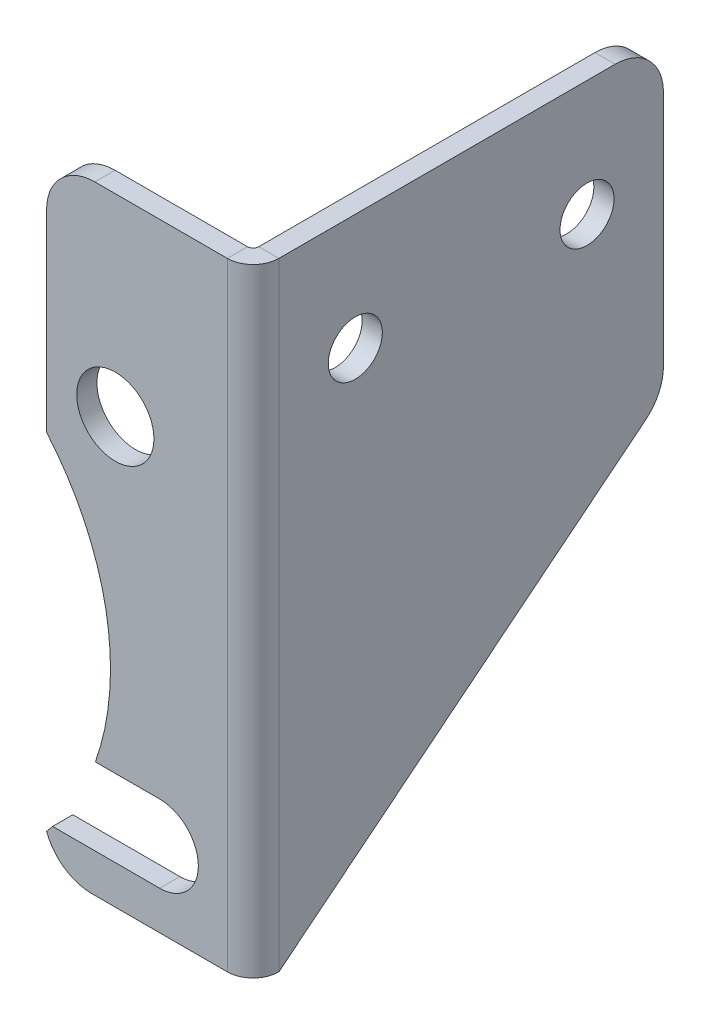
ISO-10303-21;
HEADER;
FILE_DESCRIPTION(('STEP AP214'),'2;1');
FILE_NAME('part.step','',(''),(''),'','','');
FILE_SCHEMA(('AUTOMOTIVE_DESIGN { 1 0 10303 214 1 1 1 1 }'));
ENDSEC;
DATA;
#1=APPLICATION_CONTEXT('core data for automotive mechanical design processes');
#2=APPLICATION_PROTOCOL_DEFINITION('international standard','automotive_design',2000,#1);
#3=PRODUCT_CONTEXT('',#1,'mechanical');
#4=PRODUCT('Part','Part','',(#3));
#5=PRODUCT_RELATED_PRODUCT_CATEGORY('part','',(#4));
#6=PRODUCT_DEFINITION_FORMATION('','',#4);
#7=PRODUCT_DEFINITION_CONTEXT('part definition',#1,'design');
#8=PRODUCT_DEFINITION('design','',#6,#7);
#9=PRODUCT_DEFINITION_SHAPE('','',#8);
#10=(LENGTH_UNIT() NAMED_UNIT(*) SI_UNIT(.MILLI.,.METRE.));
#11=(NAMED_UNIT(*) PLANE_ANGLE_UNIT() SI_UNIT($,.RADIAN.));
#12=(NAMED_UNIT(*) SI_UNIT($,.STERADIAN.) SOLID_ANGLE_UNIT());
#13=UNCERTAINTY_MEASURE_WITH_UNIT(LENGTH_MEASURE(1.E-05),#10,'distance_accuracy_value','');
#14=(GEOMETRIC_REPRESENTATION_CONTEXT(3) GLOBAL_UNCERTAINTY_ASSIGNED_CONTEXT((#13)) GLOBAL_UNIT_ASSIGNED_CONTEXT((#10,
#11,#12)) REPRESENTATION_CONTEXT('',''));
#15=CARTESIAN_POINT('',(0.,0.,0.));
#16=DIRECTION('',(0.,0.,1.));
#17=DIRECTION('',(1.,0.,0.));
#18=AXIS2_PLACEMENT_3D('',#15,#16,#17);
#19=CARTESIAN_POINT('',(15.28064,0.,0.));
#20=DIRECTION('',(-1.,0.,0.));
#21=DIRECTION('',(0.,0.,1.));
#22=AXIS2_PLACEMENT_3D('',#19,#20,#21);
#23=PLANE('',#22);
#24=CARTESIAN_POINT('',(15.28064,25.4,-13.44422));
#25=DIRECTION('',(1.,0.,0.));
#26=DIRECTION('',(0.,0.,-1.));
#27=AXIS2_PLACEMENT_3D('',#24,#25,#26);
#28=CIRCLE('',#27,3.556);
#29=CARTESIAN_POINT('',(15.28064,25.4,-17.00022));
#30=VERTEX_POINT('',#29);
#31=EDGE_CURVE('E638',#30,#30,#28,.T.);
#32=ORIENTED_EDGE('',*,*,#31,.F.);
#33=EDGE_LOOP('',(#32));
#34=FACE_BOUND('',#33,.T.);
#35=DIRECTION('',(0.,1.,0.));
#36=VECTOR('',#35,1.);
#37=CARTESIAN_POINT('',(15.2806400000002,0.,-53.975));
#38=LINE('',#37,#36);
#39=CARTESIAN_POINT('',(15.2806400000002,3.04375222965552,-53.975));
#40=VERTEX_POINT('',#39);
#41=CARTESIAN_POINT('',(15.2806400000002,34.29,-53.975));
#42=VERTEX_POINT('',#41);
#43=EDGE_CURVE('E228',#40,#42,#38,.T.);
#44=ORIENTED_EDGE('',*,*,#43,.T.);
#45=CARTESIAN_POINT('',(15.2806400000002,34.29,-47.625));
#46=DIRECTION('',(-1.,0.,0.));
#47=DIRECTION('',(0.,0.,1.));
#48=AXIS2_PLACEMENT_3D('',#45,#46,#47);
#49=CIRCLE('',#48,6.35);
#50=CARTESIAN_POINT('',(15.2806400000002,40.64,-47.625));
#51=VERTEX_POINT('',#50);
#52=EDGE_CURVE('E328',#42,#51,#49,.F.);
#53=ORIENTED_EDGE('',*,*,#52,.T.);
#54=DIRECTION('',(0.,0.,1.));
#55=VECTOR('',#54,1.);
#56=CARTESIAN_POINT('',(15.28064,40.64,0.));
#57=LINE('',#56,#55);
#58=CARTESIAN_POINT('',(15.28064,40.64,-3.39343999999999));
#59=VERTEX_POINT('',#58);
#60=EDGE_CURVE('E224',#51,#59,#57,.T.);
#61=ORIENTED_EDGE('',*,*,#60,.T.);
#62=DIRECTION('',(0.,-1.,0.));
#63=VECTOR('',#62,1.);
#64=CARTESIAN_POINT('',(15.28064,40.64,-3.39343999999999));
#65=LINE('',#64,#63);
#66=CARTESIAN_POINT('',(15.28064,-40.64,-3.39343999999997));
#67=VERTEX_POINT('',#66);
#68=EDGE_CURVE('E208',#67,#59,#65,.F.);
#69=ORIENTED_EDGE('',*,*,#68,.F.);
#70=DIRECTION('',(0.,-0.626335888215257,0.779553304869914));
#71=VECTOR('',#70,1.);
#72=CARTESIAN_POINT('',(15.28064,-40.64,-3.39343999999997));
#73=LINE('',#72,#71);
#74=CARTESIAN_POINT('',(15.2806400000002,-1.90641125626843,-51.6022328901669));
#75=VERTEX_POINT('',#74);
#76=EDGE_CURVE('E198',#75,#67,#73,.T.);
#77=ORIENTED_EDGE('',*,*,#76,.F.);
#78=CARTESIAN_POINT('',(15.2806400000002,3.04375222965552,-47.625));
#79=DIRECTION('',(-1.,0.,0.));
#80=DIRECTION('',(0.,0.,1.));
#81=AXIS2_PLACEMENT_3D('',#78,#79,#80);
#82=CIRCLE('',#81,6.35);
#83=EDGE_CURVE('E326',#75,#40,#82,.F.);
#84=ORIENTED_EDGE('',*,*,#83,.T.);
#85=EDGE_LOOP('',(#44,#53,#61,#69,#77,#84));
#86=FACE_BOUND('',#85,.T.);
#87=CARTESIAN_POINT('',(15.2806400000001,25.4,-43.92422));
#88=DIRECTION('',(1.,0.,0.));
#89=DIRECTION('',(0.,0.,-1.));
#90=AXIS2_PLACEMENT_3D('',#87,#88,#89);
#91=CIRCLE('',#90,3.55600000000001);
#92=CARTESIAN_POINT('',(15.2806400000002,25.4,-47.48022));
#93=VERTEX_POINT('',#92);
#94=EDGE_CURVE('E646',#93,#93,#91,.T.);
#95=ORIENTED_EDGE('',*,*,#94,.F.);
#96=EDGE_LOOP('',(#95));
#97=FACE_BOUND('',#96,.T.);
#98=ADVANCED_FACE('F69',(#34,#86,#97),#23,.F.);
#99=CARTESIAN_POINT('',(12.6238,0.,0.));
#100=DIRECTION('',(-1.,0.,0.));
#101=DIRECTION('',(0.,0.,1.));
#102=AXIS2_PLACEMENT_3D('',#99,#100,#101);
#103=PLANE('',#102);
#104=DIRECTION('',(0.,0.,-1.));
#105=VECTOR('',#104,1.);
#106=CARTESIAN_POINT('',(12.6238,40.64,-2.65684));
#107=LINE('',#106,#105);
#108=CARTESIAN_POINT('',(12.6238000000002,40.64,-47.625));
#109=VERTEX_POINT('',#108);
#110=CARTESIAN_POINT('',(12.6238,40.64,-3.39344));
#111=VERTEX_POINT('',#110);
#112=EDGE_CURVE('E628',#109,#111,#107,.F.);
#113=ORIENTED_EDGE('',*,*,#112,.F.);
#114=CARTESIAN_POINT('',(12.6238000000002,34.29,-47.625));
#115=DIRECTION('',(-1.,0.,0.));
#116=DIRECTION('',(0.,0.,1.));
#117=AXIS2_PLACEMENT_3D('',#114,#115,#116);
#118=CIRCLE('',#117,6.35);
#119=CARTESIAN_POINT('',(12.6238000000002,34.29,-53.975));
#120=VERTEX_POINT('',#119);
#121=EDGE_CURVE('E320',#109,#120,#118,.T.);
#122=ORIENTED_EDGE('',*,*,#121,.T.);
#123=DIRECTION('',(0.,-1.,0.));
#124=VECTOR('',#123,1.);
#125=CARTESIAN_POINT('',(12.6238000000002,40.64,-53.975));
#126=LINE('',#125,#124);
#127=CARTESIAN_POINT('',(12.6238000000002,3.04375222965552,-53.975));
#128=VERTEX_POINT('',#127);
#129=EDGE_CURVE('E630',#128,#120,#126,.F.);
#130=ORIENTED_EDGE('',*,*,#129,.F.);
#131=CARTESIAN_POINT('',(12.6238000000002,3.04375222965552,-47.625));
#132=DIRECTION('',(-1.,0.,0.));
#133=DIRECTION('',(0.,0.,1.));
#134=AXIS2_PLACEMENT_3D('',#131,#132,#133);
#135=CIRCLE('',#134,6.35);
#136=CARTESIAN_POINT('',(12.6238000000002,-1.90641125626843,-51.6022328901669));
#137=VERTEX_POINT('',#136);
#138=EDGE_CURVE('E196',#128,#137,#135,.T.);
#139=ORIENTED_EDGE('',*,*,#138,.T.);
#140=DIRECTION('',(0.,-0.626335888215257,0.779553304869914));
#141=VECTOR('',#140,1.);
#142=CARTESIAN_POINT('',(12.6238,-40.64,-3.39343999999998));
#143=LINE('',#142,#141);
#144=CARTESIAN_POINT('',(12.6238,-40.64,-3.39343999999998));
#145=VERTEX_POINT('',#144);
#146=EDGE_CURVE('E188',#137,#145,#143,.T.);
#147=ORIENTED_EDGE('',*,*,#146,.T.);
#148=DIRECTION('',(0.,-1.,0.));
#149=VECTOR('',#148,1.);
#150=CARTESIAN_POINT('',(12.6238,40.64,-3.39344));
#151=LINE('',#150,#149);
#152=EDGE_CURVE('E194',#111,#145,#151,.T.);
#153=ORIENTED_EDGE('',*,*,#152,.F.);
#154=EDGE_LOOP('',(#113,#122,#130,#139,#147,#153));
#155=FACE_BOUND('',#154,.T.);
#156=CARTESIAN_POINT('',(12.6238,25.4,-13.44422));
#157=DIRECTION('',(1.,0.,0.));
#158=DIRECTION('',(0.,0.,-1.));
#159=AXIS2_PLACEMENT_3D('',#156,#157,#158);
#160=CIRCLE('',#159,3.556);
#161=CARTESIAN_POINT('',(12.6238,25.4,-17.00022));
#162=VERTEX_POINT('',#161);
#163=EDGE_CURVE('E643',#162,#162,#160,.T.);
#164=ORIENTED_EDGE('',*,*,#163,.T.);
#165=EDGE_LOOP('',(#164));
#166=FACE_BOUND('',#165,.T.);
#167=CARTESIAN_POINT('',(12.6238000000001,25.4,-43.92422));
#168=DIRECTION('',(1.,0.,0.));
#169=DIRECTION('',(0.,0.,-1.));
#170=AXIS2_PLACEMENT_3D('',#167,#168,#169);
#171=CIRCLE('',#170,3.55600000000001);
#172=CARTESIAN_POINT('',(12.6238000000002,25.4,-47.48022));
#173=VERTEX_POINT('',#172);
#174=EDGE_CURVE('E197',#173,#173,#171,.T.);
#175=ORIENTED_EDGE('',*,*,#174,.T.);
#176=EDGE_LOOP('',(#175));
#177=FACE_BOUND('',#176,.T.);
#178=ADVANCED_FACE('F191',(#155,#166,#177),#103,.T.);
#179=CARTESIAN_POINT('',(15.2806400000002,40.64,-53.975));
#180=DIRECTION('',(0.,0.,1.));
#181=DIRECTION('',(1.,0.,0.));
#182=AXIS2_PLACEMENT_3D('',#179,#180,#181);
#183=PLANE('',#182);
#184=ORIENTED_EDGE('',*,*,#129,.T.);
#185=DIRECTION('',(-1.,0.,0.));
#186=VECTOR('',#185,1.);
#187=CARTESIAN_POINT('',(15.2806400000002,34.29,-53.975));
#188=LINE('',#187,#186);
#189=EDGE_CURVE('E90',#120,#42,#188,.F.);
#190=ORIENTED_EDGE('',*,*,#189,.T.);
#191=ORIENTED_EDGE('',*,*,#43,.F.);
#192=DIRECTION('',(-1.,0.,0.));
#193=VECTOR('',#192,1.);
#194=CARTESIAN_POINT('',(12.6238000000002,3.04375222965552,-53.975));
#195=LINE('',#194,#193);
#196=EDGE_CURVE('E322',#40,#128,#195,.T.);
#197=ORIENTED_EDGE('',*,*,#196,.T.);
#198=EDGE_LOOP('',(#184,#190,#191,#197));
#199=FACE_BOUND('',#198,.T.);
#200=ADVANCED_FACE('F401',(#199),#183,.F.);
#201=CARTESIAN_POINT('',(-11.8872,40.64,-2.65684));
#202=DIRECTION('',(-1.,0.,0.));
#203=DIRECTION('',(0.,0.,1.));
#204=AXIS2_PLACEMENT_3D('',#201,#202,#203);
#205=PLANE('',#204);
#206=DIRECTION('',(0.,-1.,0.));
#207=VECTOR('',#206,1.);
#208=CARTESIAN_POINT('',(-11.8872,40.64,0.));
#209=LINE('',#208,#207);
#210=CARTESIAN_POINT('',(-11.8872,34.29,0.));
#211=VERTEX_POINT('',#210);
#212=CARTESIAN_POINT('',(-11.8872,8.93603167868545,0.));
#213=VERTEX_POINT('',#212);
#214=EDGE_CURVE('E235',#211,#213,#209,.T.);
#215=ORIENTED_EDGE('',*,*,#214,.F.);
#216=DIRECTION('',(0.,0.,1.));
#217=VECTOR('',#216,1.);
#218=CARTESIAN_POINT('',(-11.8872,34.29,-2.65684));
#219=LINE('',#218,#217);
#220=CARTESIAN_POINT('',(-11.8872,34.29,-2.65684));
#221=VERTEX_POINT('',#220);
#222=EDGE_CURVE('E77',#211,#221,#219,.F.);
#223=ORIENTED_EDGE('',*,*,#222,.T.);
#224=DIRECTION('',(0.,-1.,0.));
#225=VECTOR('',#224,1.);
#226=CARTESIAN_POINT('',(-11.8872,40.64,-2.65684));
#227=LINE('',#226,#225);
#228=CARTESIAN_POINT('',(-11.8872,8.93603167868545,-2.65684));
#229=VERTEX_POINT('',#228);
#230=EDGE_CURVE('E240',#221,#229,#227,.T.);
#231=ORIENTED_EDGE('',*,*,#230,.T.);
#232=DIRECTION('',(0.,0.,1.));
#233=VECTOR('',#232,1.);
#234=CARTESIAN_POINT('',(-11.8872,8.93603167868545,-2.65684));
#235=LINE('',#234,#233);
#236=EDGE_CURVE('E265',#229,#213,#235,.T.);
#237=ORIENTED_EDGE('',*,*,#236,.T.);
#238=EDGE_LOOP('',(#215,#223,#231,#237));
#239=FACE_BOUND('',#238,.T.);
#240=ADVANCED_FACE('F336',(#239),#205,.T.);
#241=CARTESIAN_POINT('',(-11.8872,40.64,-2.65684));
#242=DIRECTION('',(0.,1.,0.));
#243=DIRECTION('',(0.,0.,1.));
#244=AXIS2_PLACEMENT_3D('',#241,#242,#243);
#245=PLANE('',#244);
#246=DIRECTION('',(-1.,0.,0.));
#247=VECTOR('',#246,1.);
#248=CARTESIAN_POINT('',(-11.8872,40.64,-2.65684));
#249=LINE('',#248,#247);
#250=CARTESIAN_POINT('',(11.8872,40.64,-2.65684));
#251=VERTEX_POINT('',#250);
#252=CARTESIAN_POINT('',(-5.5372,40.64,-2.65684));
#253=VERTEX_POINT('',#252);
#254=EDGE_CURVE('E262',#251,#253,#249,.T.);
#255=ORIENTED_EDGE('',*,*,#254,.T.);
#256=DIRECTION('',(0.,0.,1.));
#257=VECTOR('',#256,1.);
#258=CARTESIAN_POINT('',(-5.5372,40.64,-2.65684));
#259=LINE('',#258,#257);
#260=CARTESIAN_POINT('',(-5.5372,40.64,0.));
#261=VERTEX_POINT('',#260);
#262=EDGE_CURVE('E330',#253,#261,#259,.T.);
#263=ORIENTED_EDGE('',*,*,#262,.T.);
#264=DIRECTION('',(-1.,0.,0.));
#265=VECTOR('',#264,1.);
#266=CARTESIAN_POINT('',(-11.8872,40.64,0.));
#267=LINE('',#266,#265);
#268=CARTESIAN_POINT('',(11.8872,40.64,0.));
#269=VERTEX_POINT('',#268);
#270=EDGE_CURVE('E243',#269,#261,#267,.T.);
#271=ORIENTED_EDGE('',*,*,#270,.F.);
#272=DIRECTION('',(0.,0.,1.));
#273=VECTOR('',#272,1.);
#274=CARTESIAN_POINT('',(11.8872,40.64,-2.65684));
#275=LINE('',#274,#273);
#276=EDGE_CURVE('E289',#251,#269,#275,.T.);
#277=ORIENTED_EDGE('',*,*,#276,.F.);
#278=EDGE_LOOP('',(#255,#263,#271,#277));
#279=FACE_BOUND('',#278,.T.);
#280=ADVANCED_FACE('F350',(#279),#245,.T.);
#281=CARTESIAN_POINT('',(-11.8872,-40.64,-2.65684));
#282=DIRECTION('',(0.,-1.,0.));
#283=DIRECTION('',(0.,0.,-1.));
#284=AXIS2_PLACEMENT_3D('',#281,#282,#283);
#285=PLANE('',#284);
#286=DIRECTION('',(1.,0.,0.));
#287=VECTOR('',#286,1.);
#288=CARTESIAN_POINT('',(-11.8872,-40.64,0.));
#289=LINE('',#288,#287);
#290=CARTESIAN_POINT('',(-5.94180896771993,-40.64,0.));
#291=VERTEX_POINT('',#290);
#292=CARTESIAN_POINT('',(11.8872,-40.64,0.));
#293=VERTEX_POINT('',#292);
#294=EDGE_CURVE('E282',#291,#293,#289,.T.);
#295=ORIENTED_EDGE('',*,*,#294,.F.);
#296=DIRECTION('',(0.,0.,-1.));
#297=VECTOR('',#296,1.);
#298=CARTESIAN_POINT('',(-5.94180896771993,-40.64,-2.65684));
#299=LINE('',#298,#297);
#300=CARTESIAN_POINT('',(-5.94180896771993,-40.64,-2.65684));
#301=VERTEX_POINT('',#300);
#302=EDGE_CURVE('E310',#291,#301,#299,.T.);
#303=ORIENTED_EDGE('',*,*,#302,.T.);
#304=DIRECTION('',(1.,0.,0.));
#305=VECTOR('',#304,1.);
#306=CARTESIAN_POINT('',(-11.8872,-40.64,-2.65684));
#307=LINE('',#306,#305);
#308=CARTESIAN_POINT('',(11.8872,-40.64,-2.65684));
#309=VERTEX_POINT('',#308);
#310=EDGE_CURVE('E258',#301,#309,#307,.T.);
#311=ORIENTED_EDGE('',*,*,#310,.T.);
#312=DIRECTION('',(0.,0.,1.));
#313=VECTOR('',#312,1.);
#314=CARTESIAN_POINT('',(11.8872,-40.64,-2.65684));
#315=LINE('',#314,#313);
#316=EDGE_CURVE('E223',#309,#293,#315,.T.);
#317=ORIENTED_EDGE('',*,*,#316,.T.);
#318=EDGE_LOOP('',(#295,#303,#311,#317));
#319=FACE_BOUND('',#318,.T.);
#320=ADVANCED_FACE('F361',(#319),#285,.T.);
#321=CARTESIAN_POINT('',(-38.4048,-13.7922,-2.65684));
#322=DIRECTION('',(0.,0.,1.));
#323=DIRECTION('',(1.,0.,0.));
#324=AXIS2_PLACEMENT_3D('',#321,#322,#323);
#325=CYLINDRICAL_SURFACE('',#324,34.925);
#326=CARTESIAN_POINT('',(-38.4048,-13.7922,0.));
#327=DIRECTION('',(0.,0.,-1.));
#328=DIRECTION('',(1.,0.,0.));
#329=AXIS2_PLACEMENT_3D('',#326,#327,#328);
#330=CIRCLE('',#329,34.925);
#331=CARTESIAN_POINT('',(-11.0932912873712,-35.56,0.));
#332=VERTEX_POINT('',#331);
#333=CARTESIAN_POINT('',(-11.8872,-36.5204316786854,0.));
#334=VERTEX_POINT('',#333);
#335=EDGE_CURVE('E279',#332,#334,#330,.T.);
#336=ORIENTED_EDGE('',*,*,#335,.F.);
#337=DIRECTION('',(0.,0.,1.));
#338=VECTOR('',#337,1.);
#339=CARTESIAN_POINT('',(-11.0932912873712,-35.56,-2.65684));
#340=LINE('',#339,#338);
#341=CARTESIAN_POINT('',(-11.0932912873712,-35.56,-2.65684));
#342=VERTEX_POINT('',#341);
#343=EDGE_CURVE('E297',#342,#332,#340,.T.);
#344=ORIENTED_EDGE('',*,*,#343,.F.);
#345=CARTESIAN_POINT('',(-38.4048,-13.7922,-2.65684));
#346=DIRECTION('',(0.,0.,-1.));
#347=DIRECTION('',(1.,0.,0.));
#348=AXIS2_PLACEMENT_3D('',#345,#346,#347);
#349=CIRCLE('',#348,34.925);
#350=CARTESIAN_POINT('',(-11.8872,-36.5204316786854,-2.65684));
#351=VERTEX_POINT('',#350);
#352=EDGE_CURVE('E255',#342,#351,#349,.T.);
#353=ORIENTED_EDGE('',*,*,#352,.T.);
#354=DIRECTION('',(0.,0.,1.));
#355=VECTOR('',#354,1.);
#356=CARTESIAN_POINT('',(-11.8872,-36.5204316786854,-2.65684));
#357=LINE('',#356,#355);
#358=EDGE_CURVE('E294',#351,#334,#357,.T.);
#359=ORIENTED_EDGE('',*,*,#358,.T.);
#360=EDGE_LOOP('',(#336,#344,#353,#359));
#361=FACE_BOUND('',#360,.T.);
#362=ADVANCED_FACE('F370',(#361),#325,.F.);
#363=CARTESIAN_POINT('',(2.99720000000001,-35.56,-2.65684));
#364=DIRECTION('',(0.,1.,0.));
#365=DIRECTION('',(0.,0.,1.));
#366=AXIS2_PLACEMENT_3D('',#363,#364,#365);
#367=PLANE('',#366);
#368=DIRECTION('',(-1.,0.,0.));
#369=VECTOR('',#368,1.);
#370=CARTESIAN_POINT('',(2.99720000000001,-35.56,0.));
#371=LINE('',#370,#369);
#372=CARTESIAN_POINT('',(2.99720000000001,-35.56,0.));
#373=VERTEX_POINT('',#372);
#374=EDGE_CURVE('E276',#373,#332,#371,.T.);
#375=ORIENTED_EDGE('',*,*,#374,.F.);
#376=DIRECTION('',(0.,0.,1.));
#377=VECTOR('',#376,1.);
#378=CARTESIAN_POINT('',(2.99720000000001,-35.56,-2.65684));
#379=LINE('',#378,#377);
#380=CARTESIAN_POINT('',(2.99720000000001,-35.56,-2.65684));
#381=VERTEX_POINT('',#380);
#382=EDGE_CURVE('E299',#381,#373,#379,.T.);
#383=ORIENTED_EDGE('',*,*,#382,.F.);
#384=DIRECTION('',(-1.,0.,0.));
#385=VECTOR('',#384,1.);
#386=CARTESIAN_POINT('',(2.99720000000001,-35.56,-2.65684));
#387=LINE('',#386,#385);
#388=EDGE_CURVE('E252',#381,#342,#387,.T.);
#389=ORIENTED_EDGE('',*,*,#388,.T.);
#390=ORIENTED_EDGE('',*,*,#343,.T.);
#391=EDGE_LOOP('',(#375,#383,#389,#390));
#392=FACE_BOUND('',#391,.T.);
#393=ADVANCED_FACE('F374',(#392),#367,.T.);
#394=CARTESIAN_POINT('',(2.99720000000001,-30.48,-2.65684));
#395=DIRECTION('',(0.,0.,1.));
#396=DIRECTION('',(1.,0.,0.));
#397=AXIS2_PLACEMENT_3D('',#394,#395,#396);
#398=CYLINDRICAL_SURFACE('',#397,5.08);
#399=CARTESIAN_POINT('',(2.99720000000001,-30.48,0.));
#400=DIRECTION('',(0.,0.,-1.));
#401=DIRECTION('',(1.,0.,0.));
#402=AXIS2_PLACEMENT_3D('',#399,#400,#401);
#403=CIRCLE('',#402,5.08);
#404=CARTESIAN_POINT('',(2.99720000000001,-25.4,0.));
#405=VERTEX_POINT('',#404);
#406=EDGE_CURVE('E273',#405,#373,#403,.T.);
#407=ORIENTED_EDGE('',*,*,#406,.F.);
#408=DIRECTION('',(0.,0.,1.));
#409=VECTOR('',#408,1.);
#410=CARTESIAN_POINT('',(2.99720000000001,-25.4,-2.65684));
#411=LINE('',#410,#409);
#412=CARTESIAN_POINT('',(2.99720000000001,-25.4,-2.65684));
#413=VERTEX_POINT('',#412);
#414=EDGE_CURVE('E301',#413,#405,#411,.T.);
#415=ORIENTED_EDGE('',*,*,#414,.F.);
#416=CARTESIAN_POINT('',(2.99720000000001,-30.48,-2.65684));
#417=DIRECTION('',(0.,0.,-1.));
#418=DIRECTION('',(1.,0.,0.));
#419=AXIS2_PLACEMENT_3D('',#416,#417,#418);
#420=CIRCLE('',#419,5.08);
#421=EDGE_CURVE('E249',#413,#381,#420,.T.);
#422=ORIENTED_EDGE('',*,*,#421,.T.);
#423=ORIENTED_EDGE('',*,*,#382,.T.);
#424=EDGE_LOOP('',(#407,#415,#422,#423));
#425=FACE_BOUND('',#424,.T.);
#426=ADVANCED_FACE('F378',(#425),#398,.F.);
#427=CARTESIAN_POINT('',(2.99720000000001,-25.4,-2.65684));
#428=DIRECTION('',(0.,-1.,0.));
#429=DIRECTION('',(0.,0.,-1.));
#430=AXIS2_PLACEMENT_3D('',#427,#428,#429);
#431=PLANE('',#430);
#432=DIRECTION('',(1.,0.,0.));
#433=VECTOR('',#432,1.);
#434=CARTESIAN_POINT('',(2.99720000000001,-25.4,0.));
#435=LINE('',#434,#433);
#436=CARTESIAN_POINT('',(-5.46524013408798,-25.4,0.));
#437=VERTEX_POINT('',#436);
#438=EDGE_CURVE('E270',#437,#405,#435,.T.);
#439=ORIENTED_EDGE('',*,*,#438,.F.);
#440=DIRECTION('',(0.,0.,1.));
#441=VECTOR('',#440,1.);
#442=CARTESIAN_POINT('',(-5.46524013408798,-25.4,-2.65684));
#443=LINE('',#442,#441);
#444=CARTESIAN_POINT('',(-5.46524013408798,-25.4,-2.65684));
#445=VERTEX_POINT('',#444);
#446=EDGE_CURVE('E303',#445,#437,#443,.T.);
#447=ORIENTED_EDGE('',*,*,#446,.F.);
#448=DIRECTION('',(1.,0.,0.));
#449=VECTOR('',#448,1.);
#450=CARTESIAN_POINT('',(2.99720000000001,-25.4,-2.65684));
#451=LINE('',#450,#449);
#452=EDGE_CURVE('E246',#445,#413,#451,.T.);
#453=ORIENTED_EDGE('',*,*,#452,.T.);
#454=ORIENTED_EDGE('',*,*,#414,.T.);
#455=EDGE_LOOP('',(#439,#447,#453,#454));
#456=FACE_BOUND('',#455,.T.);
#457=ADVANCED_FACE('F381',(#456),#431,.T.);
#458=CARTESIAN_POINT('',(-38.4048,-13.7922,-2.65684));
#459=DIRECTION('',(0.,0.,1.));
#460=DIRECTION('',(1.,0.,0.));
#461=AXIS2_PLACEMENT_3D('',#458,#459,#460);
#462=CYLINDRICAL_SURFACE('',#461,34.925);
#463=CARTESIAN_POINT('',(-38.4048,-13.7922,0.));
#464=DIRECTION('',(0.,0.,-1.));
#465=DIRECTION('',(1.,0.,0.));
#466=AXIS2_PLACEMENT_3D('',#463,#464,#465);
#467=CIRCLE('',#466,34.925);
#468=EDGE_CURVE('E267',#213,#437,#467,.T.);
#469=ORIENTED_EDGE('',*,*,#468,.F.);
#470=ORIENTED_EDGE('',*,*,#236,.F.);
#471=CARTESIAN_POINT('',(-38.4048,-13.7922,-2.65684));
#472=DIRECTION('',(0.,0.,-1.));
#473=DIRECTION('',(1.,0.,0.));
#474=AXIS2_PLACEMENT_3D('',#471,#472,#473);
#475=CIRCLE('',#474,34.925);
#476=EDGE_CURVE('E242',#229,#445,#475,.T.);
#477=ORIENTED_EDGE('',*,*,#476,.T.);
#478=ORIENTED_EDGE('',*,*,#446,.T.);
#479=EDGE_LOOP('',(#469,#470,#477,#478));
#480=FACE_BOUND('',#479,.T.);
#481=ADVANCED_FACE('F384',(#480),#462,.F.);
#482=CARTESIAN_POINT('',(-38.4048,-13.7922,-2.65684));
#483=DIRECTION('',(0.,0.,1.));
#484=DIRECTION('',(1.,0.,0.));
#485=AXIS2_PLACEMENT_3D('',#482,#483,#484);
#486=PLANE('',#485);
#487=CARTESIAN_POINT('',(-2.84479999999999,15.24,-2.65684));
#488=DIRECTION('',(0.,0.,1.));
#489=DIRECTION('',(1.,0.,0.));
#490=AXIS2_PLACEMENT_3D('',#487,#488,#489);
#491=CIRCLE('',#490,5.08);
#492=CARTESIAN_POINT('',(2.23520000000001,15.24,-2.65684));
#493=VERTEX_POINT('',#492);
#494=EDGE_CURVE('E232',#493,#493,#491,.T.);
#495=ORIENTED_EDGE('',*,*,#494,.T.);
#496=EDGE_LOOP('',(#495));
#497=FACE_BOUND('',#496,.T.);
#498=ORIENTED_EDGE('',*,*,#310,.F.);
#499=CARTESIAN_POINT('',(-5.94180896771993,-34.29,-2.65684));
#500=DIRECTION('',(0.,0.,1.));
#501=DIRECTION('',(1.,0.,0.));
#502=AXIS2_PLACEMENT_3D('',#499,#500,#501);
#503=CIRCLE('',#502,6.35);
#504=EDGE_CURVE('E314',#301,#351,#503,.F.);
#505=ORIENTED_EDGE('',*,*,#504,.T.);
#506=ORIENTED_EDGE('',*,*,#352,.F.);
#507=ORIENTED_EDGE('',*,*,#388,.F.);
#508=ORIENTED_EDGE('',*,*,#421,.F.);
#509=ORIENTED_EDGE('',*,*,#452,.F.);
#510=ORIENTED_EDGE('',*,*,#476,.F.);
#511=ORIENTED_EDGE('',*,*,#230,.F.);
#512=CARTESIAN_POINT('',(-5.5372,34.29,-2.65684));
#513=DIRECTION('',(0.,0.,1.));
#514=DIRECTION('',(1.,0.,0.));
#515=AXIS2_PLACEMENT_3D('',#512,#513,#514);
#516=CIRCLE('',#515,6.35);
#517=EDGE_CURVE('E312',#221,#253,#516,.F.);
#518=ORIENTED_EDGE('',*,*,#517,.T.);
#519=ORIENTED_EDGE('',*,*,#254,.F.);
#520=DIRECTION('',(0.,1.,0.));
#521=VECTOR('',#520,1.);
#522=CARTESIAN_POINT('',(11.8872,40.64,-2.65684));
#523=LINE('',#522,#521);
#524=EDGE_CURVE('E260',#309,#251,#523,.T.);
#525=ORIENTED_EDGE('',*,*,#524,.F.);
#526=EDGE_LOOP('',(#498,#505,#506,#507,#508,#509,#510,#511,#518,#519,#525));
#527=FACE_BOUND('',#526,.T.);
#528=ADVANCED_FACE('F343',(#497,#527),#486,.F.);
#529=CARTESIAN_POINT('',(-38.4048,-13.7922,0.));
#530=DIRECTION('',(0.,0.,1.));
#531=DIRECTION('',(1.,0.,0.));
#532=AXIS2_PLACEMENT_3D('',#529,#530,#531);
#533=PLANE('',#532);
#534=CARTESIAN_POINT('',(-2.84479999999999,15.24,0.));
#535=DIRECTION('',(0.,0.,1.));
#536=DIRECTION('',(1.,0.,0.));
#537=AXIS2_PLACEMENT_3D('',#534,#535,#536);
#538=CIRCLE('',#537,5.08);
#539=CARTESIAN_POINT('',(2.23520000000001,15.24,0.));
#540=VERTEX_POINT('',#539);
#541=EDGE_CURVE('E236',#540,#540,#538,.T.);
#542=ORIENTED_EDGE('',*,*,#541,.F.);
#543=EDGE_LOOP('',(#542));
#544=FACE_BOUND('',#543,.T.);
#545=ORIENTED_EDGE('',*,*,#335,.T.);
#546=CARTESIAN_POINT('',(-5.94180896771993,-34.29,0.));
#547=DIRECTION('',(0.,0.,1.));
#548=DIRECTION('',(1.,0.,0.));
#549=AXIS2_PLACEMENT_3D('',#546,#547,#548);
#550=CIRCLE('',#549,6.35);
#551=EDGE_CURVE('E308',#334,#291,#550,.T.);
#552=ORIENTED_EDGE('',*,*,#551,.T.);
#553=ORIENTED_EDGE('',*,*,#294,.T.);
#554=DIRECTION('',(0.,1.,0.));
#555=VECTOR('',#554,1.);
#556=CARTESIAN_POINT('',(11.8872,40.64,0.));
#557=LINE('',#556,#555);
#558=EDGE_CURVE('E284',#293,#269,#557,.T.);
#559=ORIENTED_EDGE('',*,*,#558,.T.);
#560=ORIENTED_EDGE('',*,*,#270,.T.);
#561=CARTESIAN_POINT('',(-5.5372,34.29,0.));
#562=DIRECTION('',(0.,0.,1.));
#563=DIRECTION('',(1.,0.,0.));
#564=AXIS2_PLACEMENT_3D('',#561,#562,#563);
#565=CIRCLE('',#564,6.35);
#566=EDGE_CURVE('E292',#261,#211,#565,.T.);
#567=ORIENTED_EDGE('',*,*,#566,.T.);
#568=ORIENTED_EDGE('',*,*,#214,.T.);
#569=ORIENTED_EDGE('',*,*,#468,.T.);
#570=ORIENTED_EDGE('',*,*,#438,.T.);
#571=ORIENTED_EDGE('',*,*,#406,.T.);
#572=ORIENTED_EDGE('',*,*,#374,.T.);
#573=EDGE_LOOP('',(#545,#552,#553,#559,#560,#567,#568,#569,#570,#571,#572));
#574=FACE_BOUND('',#573,.T.);
#575=ADVANCED_FACE('F353',(#544,#574),#533,.T.);
#576=CARTESIAN_POINT('',(-2.84479999999999,15.24,-2.65684));
#577=DIRECTION('',(0.,0.,1.));
#578=DIRECTION('',(1.,0.,0.));
#579=AXIS2_PLACEMENT_3D('',#576,#577,#578);
#580=CYLINDRICAL_SURFACE('',#579,5.08);
#581=ORIENTED_EDGE('',*,*,#494,.F.);
#582=EDGE_LOOP('',(#581));
#583=FACE_BOUND('',#582,.T.);
#584=ORIENTED_EDGE('',*,*,#541,.T.);
#585=EDGE_LOOP('',(#584));
#586=FACE_BOUND('',#585,.T.);
#587=ADVANCED_FACE('F422',(#583,#586),#580,.F.);
#588=CARTESIAN_POINT('',(11.8872,40.64,-3.39344));
#589=DIRECTION('',(0.,1.,0.));
#590=DIRECTION('',(0.,0.,1.));
#591=AXIS2_PLACEMENT_3D('',#588,#589,#590);
#592=PLANE('',#591);
#593=DIRECTION('',(-1.,0.,0.));
#594=VECTOR('',#593,1.);
#595=CARTESIAN_POINT('',(15.28064,40.64,-3.39343999999999));
#596=LINE('',#595,#594);
#597=EDGE_CURVE('E218',#111,#59,#596,.F.);
#598=ORIENTED_EDGE('',*,*,#597,.F.);
#599=CARTESIAN_POINT('',(11.8872,40.64,-3.39344));
#600=DIRECTION('',(0.,-1.,0.));
#601=DIRECTION('',(0.,0.,-1.));
#602=AXIS2_PLACEMENT_3D('',#599,#600,#601);
#603=CIRCLE('',#602,0.7366);
#604=EDGE_CURVE('E217',#251,#111,#603,.F.);
#605=ORIENTED_EDGE('',*,*,#604,.F.);
#606=ORIENTED_EDGE('',*,*,#276,.T.);
#607=CARTESIAN_POINT('',(11.8872,40.64,-3.39344));
#608=DIRECTION('',(0.,-1.,0.));
#609=DIRECTION('',(0.,0.,-1.));
#610=AXIS2_PLACEMENT_3D('',#607,#608,#609);
#611=CIRCLE('',#610,3.39344);
#612=EDGE_CURVE('E239',#269,#59,#611,.F.);
#613=ORIENTED_EDGE('',*,*,#612,.T.);
#614=EDGE_LOOP('',(#598,#605,#606,#613));
#615=FACE_BOUND('',#614,.T.);
#616=ADVANCED_FACE('F419',(#615),#592,.T.);
#617=CARTESIAN_POINT('',(11.8872,-40.64,-3.39344));
#618=DIRECTION('',(0.,1.,0.));
#619=DIRECTION('',(0.,0.,1.));
#620=AXIS2_PLACEMENT_3D('',#617,#618,#619);
#621=PLANE('',#620);
#622=CARTESIAN_POINT('',(11.8872,-40.64,-3.39344));
#623=DIRECTION('',(0.,-1.,0.));
#624=DIRECTION('',(0.,0.,-1.));
#625=AXIS2_PLACEMENT_3D('',#622,#623,#624);
#626=CIRCLE('',#625,0.7366);
#627=EDGE_CURVE('E214',#145,#309,#626,.T.);
#628=ORIENTED_EDGE('',*,*,#627,.F.);
#629=DIRECTION('',(-1.,0.,0.));
#630=VECTOR('',#629,1.);
#631=CARTESIAN_POINT('',(12.6238,-40.64,-3.39344));
#632=LINE('',#631,#630);
#633=EDGE_CURVE('E201',#145,#67,#632,.F.);
#634=ORIENTED_EDGE('',*,*,#633,.T.);
#635=CARTESIAN_POINT('',(11.8872,-40.64,-3.39344));
#636=DIRECTION('',(0.,-1.,0.));
#637=DIRECTION('',(0.,0.,-1.));
#638=AXIS2_PLACEMENT_3D('',#635,#636,#637);
#639=CIRCLE('',#638,3.39344);
#640=EDGE_CURVE('E226',#67,#293,#639,.T.);
#641=ORIENTED_EDGE('',*,*,#640,.T.);
#642=ORIENTED_EDGE('',*,*,#316,.F.);
#643=EDGE_LOOP('',(#628,#634,#641,#642));
#644=FACE_BOUND('',#643,.T.);
#645=ADVANCED_FACE('F221',(#644),#621,.F.);
#646=CARTESIAN_POINT('',(11.8872,-40.64,-3.39344));
#647=DIRECTION('',(0.,-1.,0.));
#648=DIRECTION('',(1.,0.,0.));
#649=AXIS2_PLACEMENT_3D('',#646,#647,#648);
#650=CYLINDRICAL_SURFACE('',#649,3.39344);
#651=ORIENTED_EDGE('',*,*,#558,.F.);
#652=ORIENTED_EDGE('',*,*,#640,.F.);
#653=ORIENTED_EDGE('',*,*,#68,.T.);
#654=ORIENTED_EDGE('',*,*,#612,.F.);
#655=EDGE_LOOP('',(#651,#652,#653,#654));
#656=FACE_BOUND('',#655,.T.);
#657=ADVANCED_FACE('F357',(#656),#650,.T.);
#658=CARTESIAN_POINT('',(11.8872,-40.64,-3.39344));
#659=DIRECTION('',(0.,-1.,0.));
#660=DIRECTION('',(1.,0.,0.));
#661=AXIS2_PLACEMENT_3D('',#658,#659,#660);
#662=CYLINDRICAL_SURFACE('',#661,0.7366);
#663=ORIENTED_EDGE('',*,*,#524,.T.);
#664=ORIENTED_EDGE('',*,*,#604,.T.);
#665=ORIENTED_EDGE('',*,*,#152,.T.);
#666=ORIENTED_EDGE('',*,*,#627,.T.);
#667=EDGE_LOOP('',(#663,#664,#665,#666));
#668=FACE_BOUND('',#667,.T.);
#669=ADVANCED_FACE('F213',(#668),#662,.F.);
#670=CARTESIAN_POINT('',(15.28064,40.64,-2.65683999999999));
#671=DIRECTION('',(0.,-1.,0.));
#672=DIRECTION('',(0.,0.,-1.));
#673=AXIS2_PLACEMENT_3D('',#670,#671,#672);
#674=PLANE('',#673);
#675=ORIENTED_EDGE('',*,*,#60,.F.);
#676=DIRECTION('',(-1.,0.,0.));
#677=VECTOR('',#676,1.);
#678=CARTESIAN_POINT('',(15.2806400000002,40.64,-47.625));
#679=LINE('',#678,#677);
#680=EDGE_CURVE('E316',#51,#109,#679,.T.);
#681=ORIENTED_EDGE('',*,*,#680,.T.);
#682=ORIENTED_EDGE('',*,*,#112,.T.);
#683=ORIENTED_EDGE('',*,*,#597,.T.);
#684=EDGE_LOOP('',(#675,#681,#682,#683));
#685=FACE_BOUND('',#684,.T.);
#686=ADVANCED_FACE('F409',(#685),#674,.F.);
#687=CARTESIAN_POINT('',(12.6238,25.4,-13.44422));
#688=DIRECTION('',(1.,0.,0.));
#689=DIRECTION('',(0.,0.,-1.));
#690=AXIS2_PLACEMENT_3D('',#687,#688,#689);
#691=CYLINDRICAL_SURFACE('',#690,3.556);
#692=ORIENTED_EDGE('',*,*,#31,.T.);
#693=EDGE_LOOP('',(#692));
#694=FACE_BOUND('',#693,.T.);
#695=ORIENTED_EDGE('',*,*,#163,.F.);
#696=EDGE_LOOP('',(#695));
#697=FACE_BOUND('',#696,.T.);
#698=ADVANCED_FACE('F406',(#694,#697),#691,.F.);
#699=CARTESIAN_POINT('',(15.28064,-40.64,-3.39343999999997));
#700=DIRECTION('',(0.,-0.779553304869914,-0.626335888215257));
#701=DIRECTION('',(0.,-0.626335888215257,0.779553304869914));
#702=AXIS2_PLACEMENT_3D('',#699,#700,#701);
#703=PLANE('',#702);
#704=ORIENTED_EDGE('',*,*,#146,.F.);
#705=DIRECTION('',(-1.,0.,0.));
#706=VECTOR('',#705,1.);
#707=CARTESIAN_POINT('',(15.2806400000002,-1.90641125626843,-51.6022328901669));
#708=LINE('',#707,#706);
#709=EDGE_CURVE('E15',#137,#75,#708,.F.);
#710=ORIENTED_EDGE('',*,*,#709,.T.);
#711=ORIENTED_EDGE('',*,*,#76,.T.);
#712=ORIENTED_EDGE('',*,*,#633,.F.);
#713=EDGE_LOOP('',(#704,#710,#711,#712));
#714=FACE_BOUND('',#713,.T.);
#715=ADVANCED_FACE('F202',(#714),#703,.T.);
#716=CARTESIAN_POINT('',(12.6238000000001,25.4,-43.92422));
#717=DIRECTION('',(1.,0.,0.));
#718=DIRECTION('',(0.,0.,-1.));
#719=AXIS2_PLACEMENT_3D('',#716,#717,#718);
#720=CYLINDRICAL_SURFACE('',#719,3.55600000000001);
#721=ORIENTED_EDGE('',*,*,#94,.T.);
#722=EDGE_LOOP('',(#721));
#723=FACE_BOUND('',#722,.T.);
#724=ORIENTED_EDGE('',*,*,#174,.F.);
#725=EDGE_LOOP('',(#724));
#726=FACE_BOUND('',#725,.T.);
#727=ADVANCED_FACE('F510',(#723,#726),#720,.F.);
#728=CARTESIAN_POINT('',(-5.94180896771993,-34.29,-2.65684));
#729=DIRECTION('',(0.,0.,1.));
#730=DIRECTION('',(1.,0.,0.));
#731=AXIS2_PLACEMENT_3D('',#728,#729,#730);
#732=CYLINDRICAL_SURFACE('',#731,6.35);
#733=ORIENTED_EDGE('',*,*,#504,.F.);
#734=ORIENTED_EDGE('',*,*,#302,.F.);
#735=ORIENTED_EDGE('',*,*,#551,.F.);
#736=ORIENTED_EDGE('',*,*,#358,.F.);
#737=EDGE_LOOP('',(#733,#734,#735,#736));
#738=FACE_BOUND('',#737,.T.);
#739=ADVANCED_FACE('F367',(#738),#732,.T.);
#740=CARTESIAN_POINT('',(15.2806400000002,34.29,-47.625));
#741=DIRECTION('',(-1.,0.,0.));
#742=DIRECTION('',(0.,0.,1.));
#743=AXIS2_PLACEMENT_3D('',#740,#741,#742);
#744=CYLINDRICAL_SURFACE('',#743,6.35);
#745=ORIENTED_EDGE('',*,*,#52,.F.);
#746=ORIENTED_EDGE('',*,*,#189,.F.);
#747=ORIENTED_EDGE('',*,*,#121,.F.);
#748=ORIENTED_EDGE('',*,*,#680,.F.);
#749=EDGE_LOOP('',(#745,#746,#747,#748));
#750=FACE_BOUND('',#749,.T.);
#751=ADVANCED_FACE('F596',(#750),#744,.T.);
#752=CARTESIAN_POINT('',(-5.5372,34.29,-2.65684));
#753=DIRECTION('',(0.,0.,1.));
#754=DIRECTION('',(1.,0.,0.));
#755=AXIS2_PLACEMENT_3D('',#752,#753,#754);
#756=CYLINDRICAL_SURFACE('',#755,6.35);
#757=ORIENTED_EDGE('',*,*,#517,.F.);
#758=ORIENTED_EDGE('',*,*,#222,.F.);
#759=ORIENTED_EDGE('',*,*,#566,.F.);
#760=ORIENTED_EDGE('',*,*,#262,.F.);
#761=EDGE_LOOP('',(#757,#758,#759,#760));
#762=FACE_BOUND('',#761,.T.);
#763=ADVANCED_FACE('F347',(#762),#756,.T.);
#764=CARTESIAN_POINT('',(15.2806400000002,3.04375222965552,-47.625));
#765=DIRECTION('',(1.,0.,0.));
#766=DIRECTION('',(0.,0.,-1.));
#767=AXIS2_PLACEMENT_3D('',#764,#765,#766);
#768=CYLINDRICAL_SURFACE('',#767,6.35);
#769=ORIENTED_EDGE('',*,*,#83,.F.);
#770=ORIENTED_EDGE('',*,*,#709,.F.);
#771=ORIENTED_EDGE('',*,*,#138,.F.);
#772=ORIENTED_EDGE('',*,*,#196,.F.);
#773=EDGE_LOOP('',(#769,#770,#771,#772));
#774=FACE_BOUND('',#773,.T.);
#775=ADVANCED_FACE('F71',(#774),#768,.T.);
#776=CLOSED_SHELL('',(#98,#178,#200,#240,#280,#320,#362,#393,#426,#457,#481,#528,#575,#587,#616,
#645,#657,#669,#686,#698,#715,#727,#739,#751,#763,#775));
#777=MANIFOLD_SOLID_BREP('B2',#776);
#778=ADVANCED_BREP_SHAPE_REPRESENTATION('',(#18,#777),#14);
#779=SHAPE_DEFINITION_REPRESENTATION(#9,#778);
ENDSEC;
END-ISO-10303-21;
